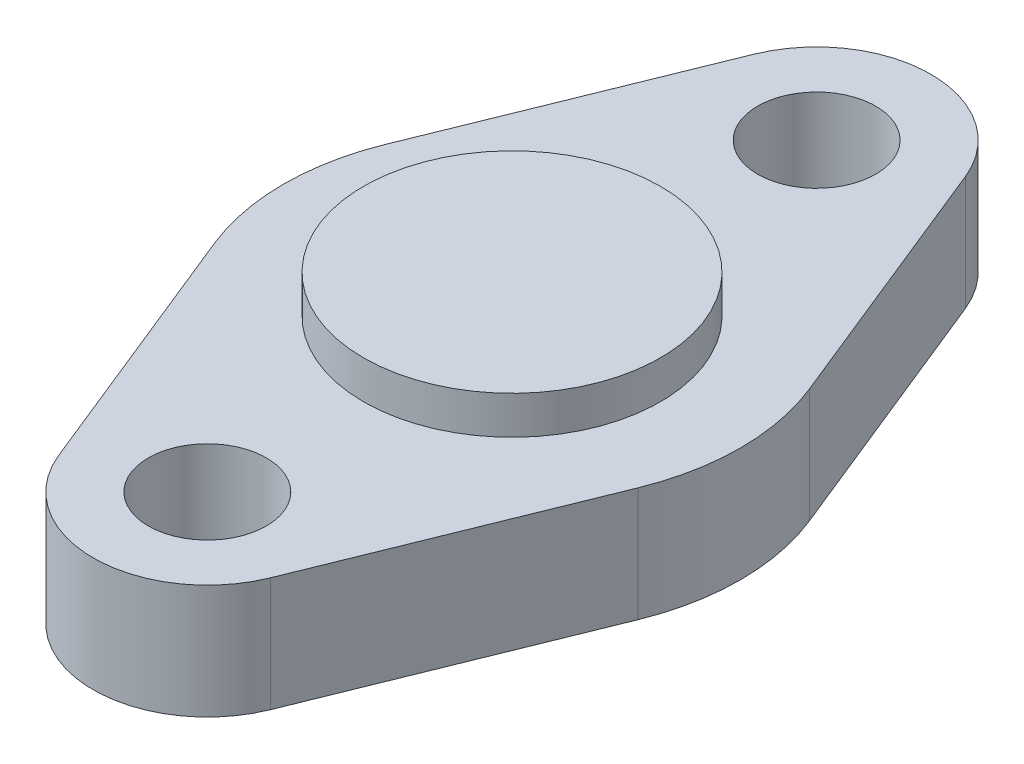
ISO-10303-21;
HEADER;
FILE_DESCRIPTION(('STEP AP214'),'2;1');
FILE_NAME('part.step','',(''),(''),'','','');
FILE_SCHEMA(('AUTOMOTIVE_DESIGN { 1 0 10303 214 1 1 1 1 }'));
ENDSEC;
DATA;
#1=APPLICATION_CONTEXT('core data for automotive mechanical design processes');
#2=APPLICATION_PROTOCOL_DEFINITION('international standard','automotive_design',2000,#1);
#3=PRODUCT_CONTEXT('',#1,'mechanical');
#4=PRODUCT('Part','Part','',(#3));
#5=PRODUCT_RELATED_PRODUCT_CATEGORY('part','',(#4));
#6=PRODUCT_DEFINITION_FORMATION('','',#4);
#7=PRODUCT_DEFINITION_CONTEXT('part definition',#1,'design');
#8=PRODUCT_DEFINITION('design','',#6,#7);
#9=PRODUCT_DEFINITION_SHAPE('','',#8);
#10=(LENGTH_UNIT() NAMED_UNIT(*) SI_UNIT(.MILLI.,.METRE.));
#11=(NAMED_UNIT(*) PLANE_ANGLE_UNIT() SI_UNIT($,.RADIAN.));
#12=(NAMED_UNIT(*) SI_UNIT($,.STERADIAN.) SOLID_ANGLE_UNIT());
#13=UNCERTAINTY_MEASURE_WITH_UNIT(LENGTH_MEASURE(1.E-05),#10,'distance_accuracy_value','');
#14=(GEOMETRIC_REPRESENTATION_CONTEXT(3) GLOBAL_UNCERTAINTY_ASSIGNED_CONTEXT((#13)) GLOBAL_UNIT_ASSIGNED_CONTEXT((#10,
#11,#12)) REPRESENTATION_CONTEXT('',''));
#15=CARTESIAN_POINT('',(0.,0.,0.));
#16=DIRECTION('',(0.,0.,1.));
#17=DIRECTION('',(1.,0.,0.));
#18=AXIS2_PLACEMENT_3D('',#15,#16,#17);
#19=CARTESIAN_POINT('',(-8.34322329798262,3.,-3.375));
#20=DIRECTION('',(0.927024810886958,0.,0.375));
#21=DIRECTION('',(0.375,0.,-0.927024810886958));
#22=AXIS2_PLACEMENT_3D('',#19,#20,#21);
#23=PLANE('',#22);
#24=DIRECTION('',(-0.375,0.,0.927024810886958));
#25=VECTOR('',#24,1.);
#26=CARTESIAN_POINT('',(-8.34322329798262,0.,-3.375));
#27=LINE('',#26,#25);
#28=CARTESIAN_POINT('',(-2.78107443266087,0.,-17.125));
#29=VERTEX_POINT('',#28);
#30=CARTESIAN_POINT('',(-5.56214886532175,0.,-10.25));
#31=VERTEX_POINT('',#30);
#32=EDGE_CURVE('E147',#29,#31,#27,.T.);
#33=ORIENTED_EDGE('',*,*,#32,.T.);
#34=DIRECTION('',(0.,-1.,0.));
#35=VECTOR('',#34,1.);
#36=CARTESIAN_POINT('',(-5.56214886532175,3.,-10.25));
#37=LINE('',#36,#35);
#38=CARTESIAN_POINT('',(-5.56214886532175,3.,-10.25));
#39=VERTEX_POINT('',#38);
#40=EDGE_CURVE('E11',#39,#31,#37,.T.);
#41=ORIENTED_EDGE('',*,*,#40,.F.);
#42=DIRECTION('',(-0.375,0.,0.927024810886958));
#43=VECTOR('',#42,1.);
#44=CARTESIAN_POINT('',(-8.34322329798262,3.,-3.375));
#45=LINE('',#44,#43);
#46=CARTESIAN_POINT('',(-2.78107443266087,3.,-17.125));
#47=VERTEX_POINT('',#46);
#48=EDGE_CURVE('E199',#47,#39,#45,.T.);
#49=ORIENTED_EDGE('',*,*,#48,.F.);
#50=DIRECTION('',(0.,-1.,0.));
#51=VECTOR('',#50,1.);
#52=CARTESIAN_POINT('',(-2.78107443266087,3.,-17.125));
#53=LINE('',#52,#51);
#54=EDGE_CURVE('E136',#47,#29,#53,.T.);
#55=ORIENTED_EDGE('',*,*,#54,.T.);
#56=EDGE_LOOP('',(#33,#41,#49,#55));
#57=FACE_BOUND('',#56,.T.);
#58=ADVANCED_FACE('F41',(#57),#23,.F.);
#59=CARTESIAN_POINT('',(0.,3.,-8.));
#60=DIRECTION('',(0.,-1.,0.));
#61=DIRECTION('',(0.,0.,-1.));
#62=AXIS2_PLACEMENT_3D('',#59,#60,#61);
#63=CYLINDRICAL_SURFACE('',#62,6.);
#64=CARTESIAN_POINT('',(0.,0.,-8.));
#65=DIRECTION('',(0.,1.,0.));
#66=DIRECTION('',(0.,0.,1.));
#67=AXIS2_PLACEMENT_3D('',#64,#65,#66);
#68=CIRCLE('',#67,6.);
#69=CARTESIAN_POINT('',(-5.56214886532175,0.,-5.75));
#70=VERTEX_POINT('',#69);
#71=EDGE_CURVE('E151',#31,#70,#68,.T.);
#72=ORIENTED_EDGE('',*,*,#71,.T.);
#73=DIRECTION('',(0.,-1.,0.));
#74=VECTOR('',#73,1.);
#75=CARTESIAN_POINT('',(-5.56214886532175,3.,-5.75));
#76=LINE('',#75,#74);
#77=CARTESIAN_POINT('',(-5.56214886532175,3.,-5.75));
#78=VERTEX_POINT('',#77);
#79=EDGE_CURVE('E51',#78,#70,#76,.T.);
#80=ORIENTED_EDGE('',*,*,#79,.F.);
#81=CARTESIAN_POINT('',(0.,3.,-8.));
#82=DIRECTION('',(0.,1.,0.));
#83=DIRECTION('',(0.,0.,1.));
#84=AXIS2_PLACEMENT_3D('',#81,#82,#83);
#85=CIRCLE('',#84,6.);
#86=EDGE_CURVE('E100',#39,#78,#85,.T.);
#87=ORIENTED_EDGE('',*,*,#86,.F.);
#88=ORIENTED_EDGE('',*,*,#40,.T.);
#89=EDGE_LOOP('',(#72,#80,#87,#88));
#90=FACE_BOUND('',#89,.T.);
#91=ADVANCED_FACE('F180',(#90),#63,.T.);
#92=CARTESIAN_POINT('',(-2.78107443266087,3.,1.125));
#93=DIRECTION('',(-0.927024810886958,0.,0.375));
#94=DIRECTION('',(0.375,0.,0.927024810886958));
#95=AXIS2_PLACEMENT_3D('',#92,#93,#94);
#96=PLANE('',#95);
#97=DIRECTION('',(-0.375,0.,-0.927024810886958));
#98=VECTOR('',#97,1.);
#99=CARTESIAN_POINT('',(-2.78107443266087,0.,1.125));
#100=LINE('',#99,#98);
#101=CARTESIAN_POINT('',(-2.78107443266087,0.,1.125));
#102=VERTEX_POINT('',#101);
#103=EDGE_CURVE('E155',#102,#70,#100,.T.);
#104=ORIENTED_EDGE('',*,*,#103,.F.);
#105=DIRECTION('',(0.,-1.,0.));
#106=VECTOR('',#105,1.);
#107=CARTESIAN_POINT('',(-2.78107443266087,3.,1.125));
#108=LINE('',#107,#106);
#109=CARTESIAN_POINT('',(-2.78107443266087,3.,1.125));
#110=VERTEX_POINT('',#109);
#111=EDGE_CURVE('E173',#110,#102,#108,.T.);
#112=ORIENTED_EDGE('',*,*,#111,.F.);
#113=DIRECTION('',(-0.375,0.,-0.927024810886958));
#114=VECTOR('',#113,1.);
#115=CARTESIAN_POINT('',(-2.78107443266087,3.,1.125));
#116=LINE('',#115,#114);
#117=EDGE_CURVE('E179',#110,#78,#116,.T.);
#118=ORIENTED_EDGE('',*,*,#117,.T.);
#119=ORIENTED_EDGE('',*,*,#79,.T.);
#120=EDGE_LOOP('',(#104,#112,#118,#119));
#121=FACE_BOUND('',#120,.T.);
#122=ADVANCED_FACE('F177',(#121),#96,.T.);
#123=CARTESIAN_POINT('',(0.,3.,0.));
#124=DIRECTION('',(0.,-1.,0.));
#125=DIRECTION('',(0.,0.,-1.));
#126=AXIS2_PLACEMENT_3D('',#123,#124,#125);
#127=CYLINDRICAL_SURFACE('',#126,3.);
#128=CARTESIAN_POINT('',(0.,0.,0.));
#129=DIRECTION('',(0.,1.,0.));
#130=DIRECTION('',(0.,0.,1.));
#131=AXIS2_PLACEMENT_3D('',#128,#129,#130);
#132=CIRCLE('',#131,3.);
#133=CARTESIAN_POINT('',(2.78107443266087,0.,1.125));
#134=VERTEX_POINT('',#133);
#135=EDGE_CURVE('E158',#102,#134,#132,.T.);
#136=ORIENTED_EDGE('',*,*,#135,.T.);
#137=DIRECTION('',(0.,-1.,0.));
#138=VECTOR('',#137,1.);
#139=CARTESIAN_POINT('',(2.78107443266087,3.,1.125));
#140=LINE('',#139,#138);
#141=CARTESIAN_POINT('',(2.78107443266087,3.,1.125));
#142=VERTEX_POINT('',#141);
#143=EDGE_CURVE('E170',#142,#134,#140,.T.);
#144=ORIENTED_EDGE('',*,*,#143,.F.);
#145=CARTESIAN_POINT('',(0.,3.,0.));
#146=DIRECTION('',(0.,1.,0.));
#147=DIRECTION('',(0.,0.,1.));
#148=AXIS2_PLACEMENT_3D('',#145,#146,#147);
#149=CIRCLE('',#148,3.);
#150=EDGE_CURVE('E193',#110,#142,#149,.T.);
#151=ORIENTED_EDGE('',*,*,#150,.F.);
#152=ORIENTED_EDGE('',*,*,#111,.T.);
#153=EDGE_LOOP('',(#136,#144,#151,#152));
#154=FACE_BOUND('',#153,.T.);
#155=ADVANCED_FACE('F189',(#154),#127,.T.);
#156=CARTESIAN_POINT('',(2.78107443266087,3.,1.125));
#157=DIRECTION('',(-0.927024810886958,0.,-0.375));
#158=DIRECTION('',(-0.375,0.,0.927024810886958));
#159=AXIS2_PLACEMENT_3D('',#156,#157,#158);
#160=PLANE('',#159);
#161=DIRECTION('',(0.375,0.,-0.927024810886958));
#162=VECTOR('',#161,1.);
#163=CARTESIAN_POINT('',(2.78107443266087,0.,1.125));
#164=LINE('',#163,#162);
#165=CARTESIAN_POINT('',(5.56214886532175,0.,-5.75));
#166=VERTEX_POINT('',#165);
#167=EDGE_CURVE('E160',#134,#166,#164,.T.);
#168=ORIENTED_EDGE('',*,*,#167,.T.);
#169=DIRECTION('',(0.,-1.,0.));
#170=VECTOR('',#169,1.);
#171=CARTESIAN_POINT('',(5.56214886532175,3.,-5.75));
#172=LINE('',#171,#170);
#173=CARTESIAN_POINT('',(5.56214886532175,3.,-5.75));
#174=VERTEX_POINT('',#173);
#175=EDGE_CURVE('E132',#174,#166,#172,.T.);
#176=ORIENTED_EDGE('',*,*,#175,.F.);
#177=DIRECTION('',(0.375,0.,-0.927024810886958));
#178=VECTOR('',#177,1.);
#179=CARTESIAN_POINT('',(2.78107443266087,3.,1.125));
#180=LINE('',#179,#178);
#181=EDGE_CURVE('E119',#142,#174,#180,.T.);
#182=ORIENTED_EDGE('',*,*,#181,.F.);
#183=ORIENTED_EDGE('',*,*,#143,.T.);
#184=EDGE_LOOP('',(#168,#176,#182,#183));
#185=FACE_BOUND('',#184,.T.);
#186=ADVANCED_FACE('F192',(#185),#160,.F.);
#187=CARTESIAN_POINT('',(0.,3.,-8.));
#188=DIRECTION('',(0.,-1.,0.));
#189=DIRECTION('',(0.,0.,-1.));
#190=AXIS2_PLACEMENT_3D('',#187,#188,#189);
#191=CYLINDRICAL_SURFACE('',#190,6.);
#192=CARTESIAN_POINT('',(0.,0.,-8.));
#193=DIRECTION('',(0.,1.,0.));
#194=DIRECTION('',(0.,0.,1.));
#195=AXIS2_PLACEMENT_3D('',#192,#193,#194);
#196=CIRCLE('',#195,6.);
#197=CARTESIAN_POINT('',(5.56214886532175,0.,-10.25));
#198=VERTEX_POINT('',#197);
#199=EDGE_CURVE('E128',#166,#198,#196,.T.);
#200=ORIENTED_EDGE('',*,*,#199,.T.);
#201=DIRECTION('',(0.,-1.,0.));
#202=VECTOR('',#201,1.);
#203=CARTESIAN_POINT('',(5.56214886532175,3.,-10.25));
#204=LINE('',#203,#202);
#205=CARTESIAN_POINT('',(5.56214886532175,3.,-10.25));
#206=VERTEX_POINT('',#205);
#207=EDGE_CURVE('E125',#206,#198,#204,.T.);
#208=ORIENTED_EDGE('',*,*,#207,.F.);
#209=CARTESIAN_POINT('',(0.,3.,-8.));
#210=DIRECTION('',(0.,1.,0.));
#211=DIRECTION('',(0.,0.,1.));
#212=AXIS2_PLACEMENT_3D('',#209,#210,#211);
#213=CIRCLE('',#212,6.);
#214=EDGE_CURVE('E113',#174,#206,#213,.T.);
#215=ORIENTED_EDGE('',*,*,#214,.F.);
#216=ORIENTED_EDGE('',*,*,#175,.T.);
#217=EDGE_LOOP('',(#200,#208,#215,#216));
#218=FACE_BOUND('',#217,.T.);
#219=ADVANCED_FACE('F126',(#218),#191,.T.);
#220=CARTESIAN_POINT('',(8.34322329798262,3.,-3.375));
#221=DIRECTION('',(0.927024810886958,0.,-0.375));
#222=DIRECTION('',(-0.375,0.,-0.927024810886958));
#223=AXIS2_PLACEMENT_3D('',#220,#221,#222);
#224=PLANE('',#223);
#225=DIRECTION('',(0.375,0.,0.927024810886958));
#226=VECTOR('',#225,1.);
#227=CARTESIAN_POINT('',(8.34322329798262,0.,-3.375));
#228=LINE('',#227,#226);
#229=CARTESIAN_POINT('',(2.78107443266087,0.,-17.125));
#230=VERTEX_POINT('',#229);
#231=EDGE_CURVE('E163',#230,#198,#228,.T.);
#232=ORIENTED_EDGE('',*,*,#231,.F.);
#233=DIRECTION('',(0.,-1.,0.));
#234=VECTOR('',#233,1.);
#235=CARTESIAN_POINT('',(2.78107443266087,3.,-17.125));
#236=LINE('',#235,#234);
#237=CARTESIAN_POINT('',(2.78107443266087,3.,-17.125));
#238=VERTEX_POINT('',#237);
#239=EDGE_CURVE('E88',#238,#230,#236,.T.);
#240=ORIENTED_EDGE('',*,*,#239,.F.);
#241=DIRECTION('',(0.375,0.,0.927024810886958));
#242=VECTOR('',#241,1.);
#243=CARTESIAN_POINT('',(8.34322329798262,3.,-3.375));
#244=LINE('',#243,#242);
#245=EDGE_CURVE('E117',#238,#206,#244,.T.);
#246=ORIENTED_EDGE('',*,*,#245,.T.);
#247=ORIENTED_EDGE('',*,*,#207,.T.);
#248=EDGE_LOOP('',(#232,#240,#246,#247));
#249=FACE_BOUND('',#248,.T.);
#250=ADVANCED_FACE('F134',(#249),#224,.T.);
#251=CARTESIAN_POINT('',(0.,3.,0.));
#252=DIRECTION('',(0.,-1.,0.));
#253=DIRECTION('',(0.,0.,-1.));
#254=AXIS2_PLACEMENT_3D('',#251,#252,#253);
#255=CYLINDRICAL_SURFACE('',#254,1.55);
#256=CARTESIAN_POINT('',(0.,3.,0.));
#257=DIRECTION('',(0.,1.,0.));
#258=DIRECTION('',(0.,0.,1.));
#259=AXIS2_PLACEMENT_3D('',#256,#257,#258);
#260=CIRCLE('',#259,1.55);
#261=CARTESIAN_POINT('',(0.,3.,1.55));
#262=VERTEX_POINT('',#261);
#263=EDGE_CURVE('E202',#262,#262,#260,.T.);
#264=ORIENTED_EDGE('',*,*,#263,.T.);
#265=EDGE_LOOP('',(#264));
#266=FACE_BOUND('',#265,.T.);
#267=CARTESIAN_POINT('',(0.,0.,0.));
#268=DIRECTION('',(0.,1.,0.));
#269=DIRECTION('',(0.,0.,1.));
#270=AXIS2_PLACEMENT_3D('',#267,#268,#269);
#271=CIRCLE('',#270,1.55);
#272=CARTESIAN_POINT('',(0.,0.,1.55));
#273=VERTEX_POINT('',#272);
#274=EDGE_CURVE('E143',#273,#273,#271,.T.);
#275=ORIENTED_EDGE('',*,*,#274,.F.);
#276=EDGE_LOOP('',(#275));
#277=FACE_BOUND('',#276,.T.);
#278=ADVANCED_FACE('F231',(#266,#277),#255,.F.);
#279=CARTESIAN_POINT('',(0.,3.,-16.));
#280=DIRECTION('',(0.,-1.,0.));
#281=DIRECTION('',(0.,0.,-1.));
#282=AXIS2_PLACEMENT_3D('',#279,#280,#281);
#283=CYLINDRICAL_SURFACE('',#282,1.55);
#284=CARTESIAN_POINT('',(0.,3.,-16.));
#285=DIRECTION('',(0.,1.,0.));
#286=DIRECTION('',(0.,0.,1.));
#287=AXIS2_PLACEMENT_3D('',#284,#285,#286);
#288=CIRCLE('',#287,1.55);
#289=CARTESIAN_POINT('',(0.,3.,-14.45));
#290=VERTEX_POINT('',#289);
#291=EDGE_CURVE('E166',#290,#290,#288,.T.);
#292=ORIENTED_EDGE('',*,*,#291,.T.);
#293=EDGE_LOOP('',(#292));
#294=FACE_BOUND('',#293,.T.);
#295=CARTESIAN_POINT('',(0.,0.,-16.));
#296=DIRECTION('',(0.,1.,0.));
#297=DIRECTION('',(0.,0.,1.));
#298=AXIS2_PLACEMENT_3D('',#295,#296,#297);
#299=CIRCLE('',#298,1.55);
#300=CARTESIAN_POINT('',(0.,0.,-14.45));
#301=VERTEX_POINT('',#300);
#302=EDGE_CURVE('E140',#301,#301,#299,.T.);
#303=ORIENTED_EDGE('',*,*,#302,.F.);
#304=EDGE_LOOP('',(#303));
#305=FACE_BOUND('',#304,.T.);
#306=ADVANCED_FACE('F43',(#294,#305),#283,.F.);
#307=CARTESIAN_POINT('',(0.,3.,-16.));
#308=DIRECTION('',(0.,-1.,0.));
#309=DIRECTION('',(0.,0.,-1.));
#310=AXIS2_PLACEMENT_3D('',#307,#308,#309);
#311=CYLINDRICAL_SURFACE('',#310,3.);
#312=CARTESIAN_POINT('',(0.,0.,-16.));
#313=DIRECTION('',(0.,1.,0.));
#314=DIRECTION('',(0.,0.,1.));
#315=AXIS2_PLACEMENT_3D('',#312,#313,#314);
#316=CIRCLE('',#315,3.);
#317=EDGE_CURVE('E91',#230,#29,#316,.T.);
#318=ORIENTED_EDGE('',*,*,#317,.T.);
#319=ORIENTED_EDGE('',*,*,#54,.F.);
#320=CARTESIAN_POINT('',(0.,3.,-16.));
#321=DIRECTION('',(0.,1.,0.));
#322=DIRECTION('',(0.,0.,1.));
#323=AXIS2_PLACEMENT_3D('',#320,#321,#322);
#324=CIRCLE('',#323,3.);
#325=EDGE_CURVE('E59',#238,#47,#324,.T.);
#326=ORIENTED_EDGE('',*,*,#325,.F.);
#327=ORIENTED_EDGE('',*,*,#239,.T.);
#328=EDGE_LOOP('',(#318,#319,#326,#327));
#329=FACE_BOUND('',#328,.T.);
#330=ADVANCED_FACE('F225',(#329),#311,.T.);
#331=CARTESIAN_POINT('',(0.,3.,0.));
#332=DIRECTION('',(0.,1.,0.));
#333=DIRECTION('',(0.,0.,1.));
#334=AXIS2_PLACEMENT_3D('',#331,#332,#333);
#335=PLANE('',#334);
#336=CARTESIAN_POINT('',(0.,3.,-8.));
#337=DIRECTION('',(0.,1.,0.));
#338=DIRECTION('',(0.,0.,1.));
#339=AXIS2_PLACEMENT_3D('',#336,#337,#338);
#340=CIRCLE('',#339,3.9);
#341=CARTESIAN_POINT('',(0.,3.,-4.1));
#342=VERTEX_POINT('',#341);
#343=EDGE_CURVE('E207',#342,#342,#340,.T.);
#344=ORIENTED_EDGE('',*,*,#343,.F.);
#345=EDGE_LOOP('',(#344));
#346=FACE_BOUND('',#345,.T.);
#347=ORIENTED_EDGE('',*,*,#291,.F.);
#348=EDGE_LOOP('',(#347));
#349=FACE_BOUND('',#348,.T.);
#350=ORIENTED_EDGE('',*,*,#263,.F.);
#351=EDGE_LOOP('',(#350));
#352=FACE_BOUND('',#351,.T.);
#353=ORIENTED_EDGE('',*,*,#48,.T.);
#354=ORIENTED_EDGE('',*,*,#86,.T.);
#355=ORIENTED_EDGE('',*,*,#117,.F.);
#356=ORIENTED_EDGE('',*,*,#150,.T.);
#357=ORIENTED_EDGE('',*,*,#181,.T.);
#358=ORIENTED_EDGE('',*,*,#214,.T.);
#359=ORIENTED_EDGE('',*,*,#245,.F.);
#360=ORIENTED_EDGE('',*,*,#325,.T.);
#361=EDGE_LOOP('',(#353,#354,#355,#356,#357,#358,#359,#360));
#362=FACE_BOUND('',#361,.T.);
#363=ADVANCED_FACE('F115',(#346,#349,#352,#362),#335,.T.);
#364=CARTESIAN_POINT('',(0.,0.,0.));
#365=DIRECTION('',(0.,1.,0.));
#366=DIRECTION('',(0.,0.,1.));
#367=AXIS2_PLACEMENT_3D('',#364,#365,#366);
#368=PLANE('',#367);
#369=ORIENTED_EDGE('',*,*,#302,.T.);
#370=EDGE_LOOP('',(#369));
#371=FACE_BOUND('',#370,.T.);
#372=ORIENTED_EDGE('',*,*,#274,.T.);
#373=EDGE_LOOP('',(#372));
#374=FACE_BOUND('',#373,.T.);
#375=ORIENTED_EDGE('',*,*,#32,.F.);
#376=ORIENTED_EDGE('',*,*,#317,.F.);
#377=ORIENTED_EDGE('',*,*,#231,.T.);
#378=ORIENTED_EDGE('',*,*,#199,.F.);
#379=ORIENTED_EDGE('',*,*,#167,.F.);
#380=ORIENTED_EDGE('',*,*,#135,.F.);
#381=ORIENTED_EDGE('',*,*,#103,.T.);
#382=ORIENTED_EDGE('',*,*,#71,.F.);
#383=EDGE_LOOP('',(#375,#376,#377,#378,#379,#380,#381,#382));
#384=FACE_BOUND('',#383,.T.);
#385=ADVANCED_FACE('F185',(#371,#374,#384),#368,.F.);
#386=CARTESIAN_POINT('',(0.,4.,-8.));
#387=DIRECTION('',(0.,-1.,0.));
#388=DIRECTION('',(0.,0.,-1.));
#389=AXIS2_PLACEMENT_3D('',#386,#387,#388);
#390=CYLINDRICAL_SURFACE('',#389,3.9);
#391=CARTESIAN_POINT('',(0.,4.,-8.));
#392=DIRECTION('',(0.,1.,0.));
#393=DIRECTION('',(0.,0.,1.));
#394=AXIS2_PLACEMENT_3D('',#391,#392,#393);
#395=CIRCLE('',#394,3.9);
#396=CARTESIAN_POINT('',(0.,4.,-4.1));
#397=VERTEX_POINT('',#396);
#398=EDGE_CURVE('E144',#397,#397,#395,.T.);
#399=ORIENTED_EDGE('',*,*,#398,.F.);
#400=EDGE_LOOP('',(#399));
#401=FACE_BOUND('',#400,.T.);
#402=ORIENTED_EDGE('',*,*,#343,.T.);
#403=EDGE_LOOP('',(#402));
#404=FACE_BOUND('',#403,.T.);
#405=ADVANCED_FACE('F217',(#401,#404),#390,.T.);
#406=CARTESIAN_POINT('',(0.,4.,-8.));
#407=DIRECTION('',(0.,1.,0.));
#408=DIRECTION('',(0.,0.,1.));
#409=AXIS2_PLACEMENT_3D('',#406,#407,#408);
#410=PLANE('',#409);
#411=ORIENTED_EDGE('',*,*,#398,.T.);
#412=EDGE_LOOP('',(#411));
#413=FACE_BOUND('',#412,.T.);
#414=ADVANCED_FACE('F215',(#413),#410,.T.);
#415=CLOSED_SHELL('',(#58,#91,#122,#155,#186,#219,#250,#278,#306,#330,#363,#385,#405,#414));
#416=MANIFOLD_SOLID_BREP('B2',#415);
#417=ADVANCED_BREP_SHAPE_REPRESENTATION('',(#18,#416),#14);
#418=SHAPE_DEFINITION_REPRESENTATION(#9,#417);
ENDSEC;
END-ISO-10303-21;
